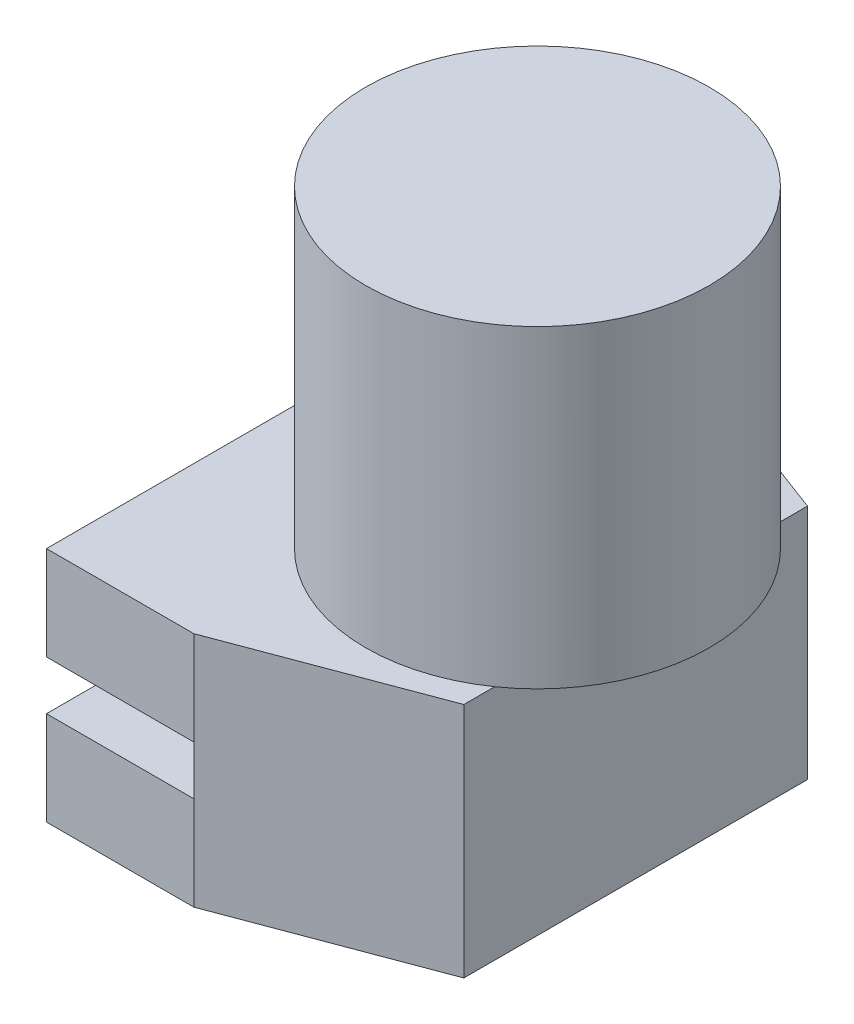
ISO-10303-21;
HEADER;
FILE_DESCRIPTION(('STEP AP214'),'2;1');
FILE_NAME('part.step','',(''),(''),'','','');
FILE_SCHEMA(('AUTOMOTIVE_DESIGN { 1 0 10303 214 1 1 1 1 }'));
ENDSEC;
DATA;
#1=APPLICATION_CONTEXT('core data for automotive mechanical design processes');
#2=APPLICATION_PROTOCOL_DEFINITION('international standard','automotive_design',2000,#1);
#3=PRODUCT_CONTEXT('',#1,'mechanical');
#4=PRODUCT('Part','Part','',(#3));
#5=PRODUCT_RELATED_PRODUCT_CATEGORY('part','',(#4));
#6=PRODUCT_DEFINITION_FORMATION('','',#4);
#7=PRODUCT_DEFINITION_CONTEXT('part definition',#1,'design');
#8=PRODUCT_DEFINITION('design','',#6,#7);
#9=PRODUCT_DEFINITION_SHAPE('','',#8);
#10=(LENGTH_UNIT() NAMED_UNIT(*) SI_UNIT(.MILLI.,.METRE.));
#11=(NAMED_UNIT(*) PLANE_ANGLE_UNIT() SI_UNIT($,.RADIAN.));
#12=(NAMED_UNIT(*) SI_UNIT($,.STERADIAN.) SOLID_ANGLE_UNIT());
#13=UNCERTAINTY_MEASURE_WITH_UNIT(LENGTH_MEASURE(1.E-05),#10,'distance_accuracy_value','');
#14=(GEOMETRIC_REPRESENTATION_CONTEXT(3) GLOBAL_UNCERTAINTY_ASSIGNED_CONTEXT((#13)) GLOBAL_UNIT_ASSIGNED_CONTEXT((#10,
#11,#12)) REPRESENTATION_CONTEXT('',''));
#15=CARTESIAN_POINT('',(0.,0.,0.));
#16=DIRECTION('',(0.,0.,1.));
#17=DIRECTION('',(1.,0.,0.));
#18=AXIS2_PLACEMENT_3D('',#15,#16,#17);
#19=CARTESIAN_POINT('',(38.1,30.6324,63.5));
#20=DIRECTION('',(0.,0.,-1.));
#21=DIRECTION('',(-1.,0.,0.));
#22=AXIS2_PLACEMENT_3D('',#19,#20,#21);
#23=PLANE('',#22);
#24=DIRECTION('',(0.,-1.,0.));
#25=VECTOR('',#24,1.);
#26=CARTESIAN_POINT('',(0.,30.6324,63.5));
#27=LINE('',#26,#25);
#28=CARTESIAN_POINT('',(0.,30.6324,63.5));
#29=VERTEX_POINT('',#28);
#30=CARTESIAN_POINT('',(0.,6.35,63.5));
#31=VERTEX_POINT('',#30);
#32=EDGE_CURVE('E200',#29,#31,#27,.T.);
#33=ORIENTED_EDGE('',*,*,#32,.T.);
#34=DIRECTION('',(-1.,0.,0.));
#35=VECTOR('',#34,1.);
#36=CARTESIAN_POINT('',(0.,6.35,63.5));
#37=LINE('',#36,#35);
#38=CARTESIAN_POINT('',(38.1,6.35,63.5));
#39=VERTEX_POINT('',#38);
#40=EDGE_CURVE('E157',#39,#31,#37,.T.);
#41=ORIENTED_EDGE('',*,*,#40,.F.);
#42=DIRECTION('',(0.,-1.,0.));
#43=VECTOR('',#42,1.);
#44=CARTESIAN_POINT('',(38.1,30.6324,63.5));
#45=LINE('',#44,#43);
#46=CARTESIAN_POINT('',(38.1,30.6324,63.5));
#47=VERTEX_POINT('',#46);
#48=EDGE_CURVE('E42',#47,#39,#45,.T.);
#49=ORIENTED_EDGE('',*,*,#48,.F.);
#50=DIRECTION('',(1.,0.,0.));
#51=VECTOR('',#50,1.);
#52=CARTESIAN_POINT('',(38.1,30.6324,63.5));
#53=LINE('',#52,#51);
#54=EDGE_CURVE('E176',#29,#47,#53,.T.);
#55=ORIENTED_EDGE('',*,*,#54,.F.);
#56=EDGE_LOOP('',(#33,#41,#49,#55));
#57=FACE_BOUND('',#56,.T.);
#58=ADVANCED_FACE('F38',(#57),#23,.F.);
#59=CARTESIAN_POINT('',(0.,30.6324,-63.5));
#60=DIRECTION('',(0.,0.,1.));
#61=DIRECTION('',(1.,0.,0.));
#62=AXIS2_PLACEMENT_3D('',#59,#60,#61);
#63=PLANE('',#62);
#64=DIRECTION('',(0.,-1.,0.));
#65=VECTOR('',#64,1.);
#66=CARTESIAN_POINT('',(38.1,30.6324,-63.5));
#67=LINE('',#66,#65);
#68=CARTESIAN_POINT('',(38.1,30.6324,-63.5));
#69=VERTEX_POINT('',#68);
#70=CARTESIAN_POINT('',(38.1,6.35,-63.5));
#71=VERTEX_POINT('',#70);
#72=EDGE_CURVE('E208',#69,#71,#67,.T.);
#73=ORIENTED_EDGE('',*,*,#72,.T.);
#74=DIRECTION('',(-1.,0.,0.));
#75=VECTOR('',#74,1.);
#76=CARTESIAN_POINT('',(0.,6.35,-63.5));
#77=LINE('',#76,#75);
#78=CARTESIAN_POINT('',(0.,6.35,-63.5));
#79=VERTEX_POINT('',#78);
#80=EDGE_CURVE('E163',#71,#79,#77,.T.);
#81=ORIENTED_EDGE('',*,*,#80,.T.);
#82=DIRECTION('',(0.,-1.,0.));
#83=VECTOR('',#82,1.);
#84=CARTESIAN_POINT('',(0.,30.6324,-63.5));
#85=LINE('',#84,#83);
#86=CARTESIAN_POINT('',(0.,30.6324,-63.5));
#87=VERTEX_POINT('',#86);
#88=EDGE_CURVE('E204',#87,#79,#85,.T.);
#89=ORIENTED_EDGE('',*,*,#88,.F.);
#90=DIRECTION('',(-1.,0.,0.));
#91=VECTOR('',#90,1.);
#92=CARTESIAN_POINT('',(0.,30.6324,-63.5));
#93=LINE('',#92,#91);
#94=EDGE_CURVE('E181',#69,#87,#93,.T.);
#95=ORIENTED_EDGE('',*,*,#94,.F.);
#96=EDGE_LOOP('',(#73,#81,#89,#95));
#97=FACE_BOUND('',#96,.T.);
#98=ADVANCED_FACE('F236',(#97),#63,.F.);
#99=CARTESIAN_POINT('',(0.,30.6324,63.5));
#100=DIRECTION('',(1.,0.,0.));
#101=DIRECTION('',(0.,0.,-1.));
#102=AXIS2_PLACEMENT_3D('',#99,#100,#101);
#103=PLANE('',#102);
#104=ORIENTED_EDGE('',*,*,#88,.T.);
#105=DIRECTION('',(0.,0.,1.));
#106=VECTOR('',#105,1.);
#107=CARTESIAN_POINT('',(0.,6.35,-63.5));
#108=LINE('',#107,#106);
#109=EDGE_CURVE('E167',#79,#31,#108,.T.);
#110=ORIENTED_EDGE('',*,*,#109,.T.);
#111=ORIENTED_EDGE('',*,*,#32,.F.);
#112=DIRECTION('',(0.,0.,1.));
#113=VECTOR('',#112,1.);
#114=CARTESIAN_POINT('',(0.,30.6324,63.5));
#115=LINE('',#114,#113);
#116=EDGE_CURVE('E183',#87,#29,#115,.T.);
#117=ORIENTED_EDGE('',*,*,#116,.F.);
#118=EDGE_LOOP('',(#104,#110,#111,#117));
#119=FACE_BOUND('',#118,.T.);
#120=ADVANCED_FACE('F231',(#119),#103,.F.);
#121=CARTESIAN_POINT('',(38.1,-6.35,63.5));
#122=VERTEX_POINT('',#121);
#123=CARTESIAN_POINT('',(38.1,-30.6324,63.5));
#124=VERTEX_POINT('',#123);
#125=EDGE_CURVE('E214',#122,#124,#45,.T.);
#126=ORIENTED_EDGE('',*,*,#125,.F.);
#127=DIRECTION('',(1.,0.,0.));
#128=VECTOR('',#127,1.);
#129=CARTESIAN_POINT('',(0.,-6.35,63.5));
#130=LINE('',#129,#128);
#131=CARTESIAN_POINT('',(0.,-6.35,63.5));
#132=VERTEX_POINT('',#131);
#133=EDGE_CURVE('E149',#132,#122,#130,.T.);
#134=ORIENTED_EDGE('',*,*,#133,.F.);
#135=CARTESIAN_POINT('',(0.,-30.6324,63.5));
#136=VERTEX_POINT('',#135);
#137=EDGE_CURVE('E185',#132,#136,#27,.T.);
#138=ORIENTED_EDGE('',*,*,#137,.T.);
#139=DIRECTION('',(1.,0.,0.));
#140=VECTOR('',#139,1.);
#141=CARTESIAN_POINT('',(38.1,-30.6324,63.5));
#142=LINE('',#141,#140);
#143=EDGE_CURVE('E170',#136,#124,#142,.T.);
#144=ORIENTED_EDGE('',*,*,#143,.T.);
#145=EDGE_LOOP('',(#126,#134,#138,#144));
#146=FACE_BOUND('',#145,.T.);
#147=ADVANCED_FACE('F40',(#146),#23,.F.);
#148=CARTESIAN_POINT('',(88.9,30.6324,44.45));
#149=DIRECTION('',(-0.351123441588392,0.,-0.936329177569044));
#150=DIRECTION('',(-0.936329177569044,0.,0.351123441588392));
#151=AXIS2_PLACEMENT_3D('',#148,#149,#150);
#152=PLANE('',#151);
#153=DIRECTION('',(0.936329177569044,0.,-0.351123441588392));
#154=VECTOR('',#153,1.);
#155=CARTESIAN_POINT('',(88.9,-30.6324,44.45));
#156=LINE('',#155,#154);
#157=CARTESIAN_POINT('',(88.9,-30.6324,44.45));
#158=VERTEX_POINT('',#157);
#159=EDGE_CURVE('E188',#124,#158,#156,.T.);
#160=ORIENTED_EDGE('',*,*,#159,.T.);
#161=DIRECTION('',(0.,-1.,0.));
#162=VECTOR('',#161,1.);
#163=CARTESIAN_POINT('',(88.9,30.6324,44.45));
#164=LINE('',#163,#162);
#165=CARTESIAN_POINT('',(88.9,30.6324,44.45));
#166=VERTEX_POINT('',#165);
#167=EDGE_CURVE('E213',#166,#158,#164,.T.);
#168=ORIENTED_EDGE('',*,*,#167,.F.);
#169=DIRECTION('',(0.936329177569044,0.,-0.351123441588392));
#170=VECTOR('',#169,1.);
#171=CARTESIAN_POINT('',(88.9,30.6324,44.45));
#172=LINE('',#171,#170);
#173=EDGE_CURVE('E124',#47,#166,#172,.T.);
#174=ORIENTED_EDGE('',*,*,#173,.F.);
#175=ORIENTED_EDGE('',*,*,#48,.T.);
#176=DIRECTION('',(0.,1.,0.));
#177=VECTOR('',#176,1.);
#178=CARTESIAN_POINT('',(38.1,-6.35,63.5));
#179=LINE('',#178,#177);
#180=EDGE_CURVE('E154',#122,#39,#179,.T.);
#181=ORIENTED_EDGE('',*,*,#180,.F.);
#182=ORIENTED_EDGE('',*,*,#125,.T.);
#183=EDGE_LOOP('',(#160,#168,#174,#175,#181,#182));
#184=FACE_BOUND('',#183,.T.);
#185=ADVANCED_FACE('F222',(#184),#152,.F.);
#186=CARTESIAN_POINT('',(88.9,30.6324,-44.45));
#187=DIRECTION('',(-1.,0.,0.));
#188=DIRECTION('',(0.,0.,1.));
#189=AXIS2_PLACEMENT_3D('',#186,#187,#188);
#190=PLANE('',#189);
#191=DIRECTION('',(0.,0.,-1.));
#192=VECTOR('',#191,1.);
#193=CARTESIAN_POINT('',(88.9,-30.6324,-44.45));
#194=LINE('',#193,#192);
#195=CARTESIAN_POINT('',(88.9,-30.6324,-44.45));
#196=VERTEX_POINT('',#195);
#197=EDGE_CURVE('E190',#158,#196,#194,.T.);
#198=ORIENTED_EDGE('',*,*,#197,.T.);
#199=DIRECTION('',(0.,-1.,0.));
#200=VECTOR('',#199,1.);
#201=CARTESIAN_POINT('',(88.9,30.6324,-44.45));
#202=LINE('',#201,#200);
#203=CARTESIAN_POINT('',(88.9,30.6324,-44.45));
#204=VERTEX_POINT('',#203);
#205=EDGE_CURVE('E211',#204,#196,#202,.T.);
#206=ORIENTED_EDGE('',*,*,#205,.F.);
#207=DIRECTION('',(0.,0.,-1.));
#208=VECTOR('',#207,1.);
#209=CARTESIAN_POINT('',(88.9,30.6324,-44.45));
#210=LINE('',#209,#208);
#211=CARTESIAN_POINT('',(88.9,30.6324,-36.4779728055165));
#212=VERTEX_POINT('',#211);
#213=EDGE_CURVE('E131',#212,#204,#210,.T.);
#214=ORIENTED_EDGE('',*,*,#213,.F.);
#215=CARTESIAN_POINT('',(88.9,30.6324,36.4779728055165));
#216=VERTEX_POINT('',#215);
#217=EDGE_CURVE('E129',#216,#212,#210,.T.);
#218=ORIENTED_EDGE('',*,*,#217,.F.);
#219=EDGE_CURVE('E120',#166,#216,#210,.T.);
#220=ORIENTED_EDGE('',*,*,#219,.F.);
#221=ORIENTED_EDGE('',*,*,#167,.T.);
#222=EDGE_LOOP('',(#198,#206,#214,#218,#220,#221));
#223=FACE_BOUND('',#222,.T.);
#224=ADVANCED_FACE('F133',(#223),#190,.F.);
#225=CARTESIAN_POINT('',(38.1,30.6324,-63.5));
#226=DIRECTION('',(-0.351123441588392,0.,0.936329177569044));
#227=DIRECTION('',(0.936329177569044,0.,0.351123441588392));
#228=AXIS2_PLACEMENT_3D('',#225,#226,#227);
#229=PLANE('',#228);
#230=DIRECTION('',(-0.936329177569044,0.,-0.351123441588392));
#231=VECTOR('',#230,1.);
#232=CARTESIAN_POINT('',(38.1,-30.6324,-63.5));
#233=LINE('',#232,#231);
#234=CARTESIAN_POINT('',(38.1,-30.6324,-63.5));
#235=VERTEX_POINT('',#234);
#236=EDGE_CURVE('E192',#196,#235,#233,.T.);
#237=ORIENTED_EDGE('',*,*,#236,.T.);
#238=CARTESIAN_POINT('',(38.1,-6.35,-63.5));
#239=VERTEX_POINT('',#238);
#240=EDGE_CURVE('E207',#239,#235,#67,.T.);
#241=ORIENTED_EDGE('',*,*,#240,.F.);
#242=DIRECTION('',(0.,1.,0.));
#243=VECTOR('',#242,1.);
#244=CARTESIAN_POINT('',(38.1,-6.35,-63.5));
#245=LINE('',#244,#243);
#246=EDGE_CURVE('E160',#239,#71,#245,.T.);
#247=ORIENTED_EDGE('',*,*,#246,.T.);
#248=ORIENTED_EDGE('',*,*,#72,.F.);
#249=DIRECTION('',(-0.936329177569044,0.,-0.351123441588392));
#250=VECTOR('',#249,1.);
#251=CARTESIAN_POINT('',(38.1,30.6324,-63.5));
#252=LINE('',#251,#250);
#253=EDGE_CURVE('E128',#204,#69,#252,.T.);
#254=ORIENTED_EDGE('',*,*,#253,.F.);
#255=ORIENTED_EDGE('',*,*,#205,.T.);
#256=EDGE_LOOP('',(#237,#241,#247,#248,#254,#255));
#257=FACE_BOUND('',#256,.T.);
#258=ADVANCED_FACE('F241',(#257),#229,.F.);
#259=CARTESIAN_POINT('',(0.,-6.35,-63.5));
#260=VERTEX_POINT('',#259);
#261=CARTESIAN_POINT('',(0.,-30.6324,-63.5));
#262=VERTEX_POINT('',#261);
#263=EDGE_CURVE('E203',#260,#262,#85,.T.);
#264=ORIENTED_EDGE('',*,*,#263,.F.);
#265=DIRECTION('',(1.,0.,0.));
#266=VECTOR('',#265,1.);
#267=CARTESIAN_POINT('',(0.,-6.35,-63.5));
#268=LINE('',#267,#266);
#269=EDGE_CURVE('E62',#260,#239,#268,.T.);
#270=ORIENTED_EDGE('',*,*,#269,.T.);
#271=ORIENTED_EDGE('',*,*,#240,.T.);
#272=DIRECTION('',(-1.,0.,0.));
#273=VECTOR('',#272,1.);
#274=CARTESIAN_POINT('',(0.,-30.6324,-63.5));
#275=LINE('',#274,#273);
#276=EDGE_CURVE('E195',#235,#262,#275,.T.);
#277=ORIENTED_EDGE('',*,*,#276,.T.);
#278=EDGE_LOOP('',(#264,#270,#271,#277));
#279=FACE_BOUND('',#278,.T.);
#280=ADVANCED_FACE('F247',(#279),#63,.F.);
#281=ORIENTED_EDGE('',*,*,#137,.F.);
#282=DIRECTION('',(0.,0.,1.));
#283=VECTOR('',#282,1.);
#284=CARTESIAN_POINT('',(0.,-6.35,-63.5));
#285=LINE('',#284,#283);
#286=EDGE_CURVE('E166',#260,#132,#285,.T.);
#287=ORIENTED_EDGE('',*,*,#286,.F.);
#288=ORIENTED_EDGE('',*,*,#263,.T.);
#289=DIRECTION('',(0.,0.,1.));
#290=VECTOR('',#289,1.);
#291=CARTESIAN_POINT('',(0.,-30.6324,63.5));
#292=LINE('',#291,#290);
#293=EDGE_CURVE('E178',#262,#136,#292,.T.);
#294=ORIENTED_EDGE('',*,*,#293,.T.);
#295=EDGE_LOOP('',(#281,#287,#288,#294));
#296=FACE_BOUND('',#295,.T.);
#297=ADVANCED_FACE('F252',(#296),#103,.F.);
#298=CARTESIAN_POINT('',(0.,30.6324,0.));
#299=DIRECTION('',(0.,-1.,0.));
#300=DIRECTION('',(0.,0.,-1.));
#301=AXIS2_PLACEMENT_3D('',#298,#299,#300);
#302=PLANE('',#301);
#303=CARTESIAN_POINT('',(63.5,30.6324,0.));
#304=DIRECTION('',(0.,1.,0.));
#305=DIRECTION('',(0.,0.,1.));
#306=AXIS2_PLACEMENT_3D('',#303,#304,#305);
#307=CIRCLE('',#306,44.45);
#308=EDGE_CURVE('E11',#212,#216,#307,.T.);
#309=ORIENTED_EDGE('',*,*,#308,.F.);
#310=ORIENTED_EDGE('',*,*,#213,.T.);
#311=ORIENTED_EDGE('',*,*,#253,.T.);
#312=ORIENTED_EDGE('',*,*,#94,.T.);
#313=ORIENTED_EDGE('',*,*,#116,.T.);
#314=ORIENTED_EDGE('',*,*,#54,.T.);
#315=ORIENTED_EDGE('',*,*,#173,.T.);
#316=ORIENTED_EDGE('',*,*,#219,.T.);
#317=EDGE_LOOP('',(#309,#310,#311,#312,#313,#314,#315,#316));
#318=FACE_BOUND('',#317,.T.);
#319=ADVANCED_FACE('F122',(#318),#302,.F.);
#320=CARTESIAN_POINT('',(0.,-30.6324,0.));
#321=DIRECTION('',(0.,-1.,0.));
#322=DIRECTION('',(0.,0.,-1.));
#323=AXIS2_PLACEMENT_3D('',#320,#321,#322);
#324=PLANE('',#323);
#325=ORIENTED_EDGE('',*,*,#143,.F.);
#326=ORIENTED_EDGE('',*,*,#293,.F.);
#327=ORIENTED_EDGE('',*,*,#276,.F.);
#328=ORIENTED_EDGE('',*,*,#236,.F.);
#329=ORIENTED_EDGE('',*,*,#197,.F.);
#330=ORIENTED_EDGE('',*,*,#159,.F.);
#331=EDGE_LOOP('',(#325,#326,#327,#328,#329,#330));
#332=FACE_BOUND('',#331,.T.);
#333=ADVANCED_FACE('F258',(#332),#324,.T.);
#334=CARTESIAN_POINT('',(0.,6.35,-63.5));
#335=DIRECTION('',(0.,1.,0.));
#336=DIRECTION('',(0.,0.,1.));
#337=AXIS2_PLACEMENT_3D('',#334,#335,#336);
#338=PLANE('',#337);
#339=ORIENTED_EDGE('',*,*,#109,.F.);
#340=ORIENTED_EDGE('',*,*,#80,.F.);
#341=DIRECTION('',(0.,0.,1.));
#342=VECTOR('',#341,1.);
#343=CARTESIAN_POINT('',(38.1,6.35,-63.5));
#344=LINE('',#343,#342);
#345=EDGE_CURVE('E171',#71,#39,#344,.T.);
#346=ORIENTED_EDGE('',*,*,#345,.T.);
#347=ORIENTED_EDGE('',*,*,#40,.T.);
#348=EDGE_LOOP('',(#339,#340,#346,#347));
#349=FACE_BOUND('',#348,.T.);
#350=ADVANCED_FACE('F228',(#349),#338,.F.);
#351=CARTESIAN_POINT('',(38.1,-6.35,-63.5));
#352=DIRECTION('',(1.,0.,0.));
#353=DIRECTION('',(0.,0.,-1.));
#354=AXIS2_PLACEMENT_3D('',#351,#352,#353);
#355=PLANE('',#354);
#356=ORIENTED_EDGE('',*,*,#345,.F.);
#357=ORIENTED_EDGE('',*,*,#246,.F.);
#358=DIRECTION('',(0.,0.,1.));
#359=VECTOR('',#358,1.);
#360=CARTESIAN_POINT('',(38.1,-6.35,-63.5));
#361=LINE('',#360,#359);
#362=EDGE_CURVE('E173',#239,#122,#361,.T.);
#363=ORIENTED_EDGE('',*,*,#362,.T.);
#364=ORIENTED_EDGE('',*,*,#180,.T.);
#365=EDGE_LOOP('',(#356,#357,#363,#364));
#366=FACE_BOUND('',#365,.T.);
#367=ADVANCED_FACE('F244',(#366),#355,.F.);
#368=CARTESIAN_POINT('',(0.,-6.35,-63.5));
#369=DIRECTION('',(0.,-1.,0.));
#370=DIRECTION('',(0.,0.,-1.));
#371=AXIS2_PLACEMENT_3D('',#368,#369,#370);
#372=PLANE('',#371);
#373=ORIENTED_EDGE('',*,*,#362,.F.);
#374=ORIENTED_EDGE('',*,*,#269,.F.);
#375=ORIENTED_EDGE('',*,*,#286,.T.);
#376=ORIENTED_EDGE('',*,*,#133,.T.);
#377=EDGE_LOOP('',(#373,#374,#375,#376));
#378=FACE_BOUND('',#377,.T.);
#379=ADVANCED_FACE('F255',(#378),#372,.F.);
#380=CARTESIAN_POINT('',(63.5,111.7854,0.));
#381=DIRECTION('',(0.,1.,0.));
#382=DIRECTION('',(0.,0.,1.));
#383=AXIS2_PLACEMENT_3D('',#380,#381,#382);
#384=PLANE('',#383);
#385=CARTESIAN_POINT('',(63.5,111.7854,0.));
#386=DIRECTION('',(0.,1.,0.));
#387=DIRECTION('',(0.,0.,1.));
#388=AXIS2_PLACEMENT_3D('',#385,#386,#387);
#389=CIRCLE('',#388,44.45);
#390=CARTESIAN_POINT('',(63.5,111.7854,44.45));
#391=VERTEX_POINT('',#390);
#392=EDGE_CURVE('E141',#391,#391,#389,.T.);
#393=ORIENTED_EDGE('',*,*,#392,.T.);
#394=EDGE_LOOP('',(#393));
#395=FACE_BOUND('',#394,.T.);
#396=ADVANCED_FACE('F336',(#395),#384,.T.);
#397=CARTESIAN_POINT('',(63.5,111.7854,0.));
#398=DIRECTION('',(0.,-1.,0.));
#399=DIRECTION('',(0.,0.,-1.));
#400=AXIS2_PLACEMENT_3D('',#397,#398,#399);
#401=CYLINDRICAL_SURFACE('',#400,44.45);
#402=ORIENTED_EDGE('',*,*,#392,.F.);
#403=EDGE_LOOP('',(#402));
#404=FACE_BOUND('',#403,.T.);
#405=EDGE_CURVE('E49',#216,#212,#307,.T.);
#406=ORIENTED_EDGE('',*,*,#405,.T.);
#407=ORIENTED_EDGE('',*,*,#308,.T.);
#408=EDGE_LOOP('',(#406,#407));
#409=FACE_BOUND('',#408,.T.);
#410=ADVANCED_FACE('F139',(#404,#409),#401,.T.);
#411=CARTESIAN_POINT('',(63.5,30.6324,0.));
#412=DIRECTION('',(0.,1.,0.));
#413=DIRECTION('',(0.,0.,1.));
#414=AXIS2_PLACEMENT_3D('',#411,#412,#413);
#415=PLANE('',#414);
#416=ORIENTED_EDGE('',*,*,#405,.F.);
#417=ORIENTED_EDGE('',*,*,#217,.T.);
#418=EDGE_LOOP('',(#416,#417));
#419=FACE_BOUND('',#418,.T.);
#420=ADVANCED_FACE('F140',(#419),#415,.F.);
#421=CLOSED_SHELL('',(#58,#98,#120,#147,#185,#224,#258,#280,#297,#319,#333,#350,#367,#379,#396,
#410,#420));
#422=CARTESIAN_POINT('',(63.5,5.2324,0.));
#423=DIRECTION('',(0.,1.,0.));
#424=DIRECTION('',(0.,0.,1.));
#425=AXIS2_PLACEMENT_3D('',#422,#423,#424);
#426=PLANE('',#425);
#427=CARTESIAN_POINT('',(63.5,5.2324,0.));
#428=DIRECTION('',(0.,1.,0.));
#429=DIRECTION('',(0.,0.,1.));
#430=AXIS2_PLACEMENT_3D('',#427,#428,#429);
#431=CIRCLE('',#430,19.05);
#432=CARTESIAN_POINT('',(63.5,5.2324,19.05));
#433=VERTEX_POINT('',#432);
#434=EDGE_CURVE('E146',#433,#433,#431,.T.);
#435=ORIENTED_EDGE('',*,*,#434,.T.);
#436=EDGE_LOOP('',(#435));
#437=FACE_BOUND('',#436,.T.);
#438=ADVANCED_FACE('F347',(#437),#426,.T.);
#439=CARTESIAN_POINT('',(63.5,5.2324,0.));
#440=DIRECTION('',(0.,1.,0.));
#441=DIRECTION('',(0.,0.,1.));
#442=AXIS2_PLACEMENT_3D('',#439,#440,#441);
#443=CYLINDRICAL_SURFACE('',#442,19.05);
#444=ORIENTED_EDGE('',*,*,#434,.F.);
#445=EDGE_LOOP('',(#444));
#446=FACE_BOUND('',#445,.T.);
#447=CARTESIAN_POINT('',(63.5,30.6324,0.));
#448=DIRECTION('',(0.,1.,0.));
#449=DIRECTION('',(0.,0.,1.));
#450=AXIS2_PLACEMENT_3D('',#447,#448,#449);
#451=CIRCLE('',#450,19.05);
#452=CARTESIAN_POINT('',(63.5,30.6324,19.05));
#453=VERTEX_POINT('',#452);
#454=EDGE_CURVE('E143',#453,#453,#451,.T.);
#455=ORIENTED_EDGE('',*,*,#454,.T.);
#456=EDGE_LOOP('',(#455));
#457=FACE_BOUND('',#456,.T.);
#458=ADVANCED_FACE('F343',(#446,#457),#443,.F.);
#459=ORIENTED_EDGE('',*,*,#454,.F.);
#460=EDGE_LOOP('',(#459));
#461=FACE_BOUND('',#460,.T.);
#462=ADVANCED_FACE('F346',(#461),#415,.F.);
#463=CLOSED_SHELL('',(#438,#458,#462));
#464=ORIENTED_CLOSED_SHELL('',*,#463,.T.);
#465=BREP_WITH_VOIDS('B2',#421,(#464));
#466=ADVANCED_BREP_SHAPE_REPRESENTATION('',(#18,#465),#14);
#467=SHAPE_DEFINITION_REPRESENTATION(#9,#466);
ENDSEC;
END-ISO-10303-21;
